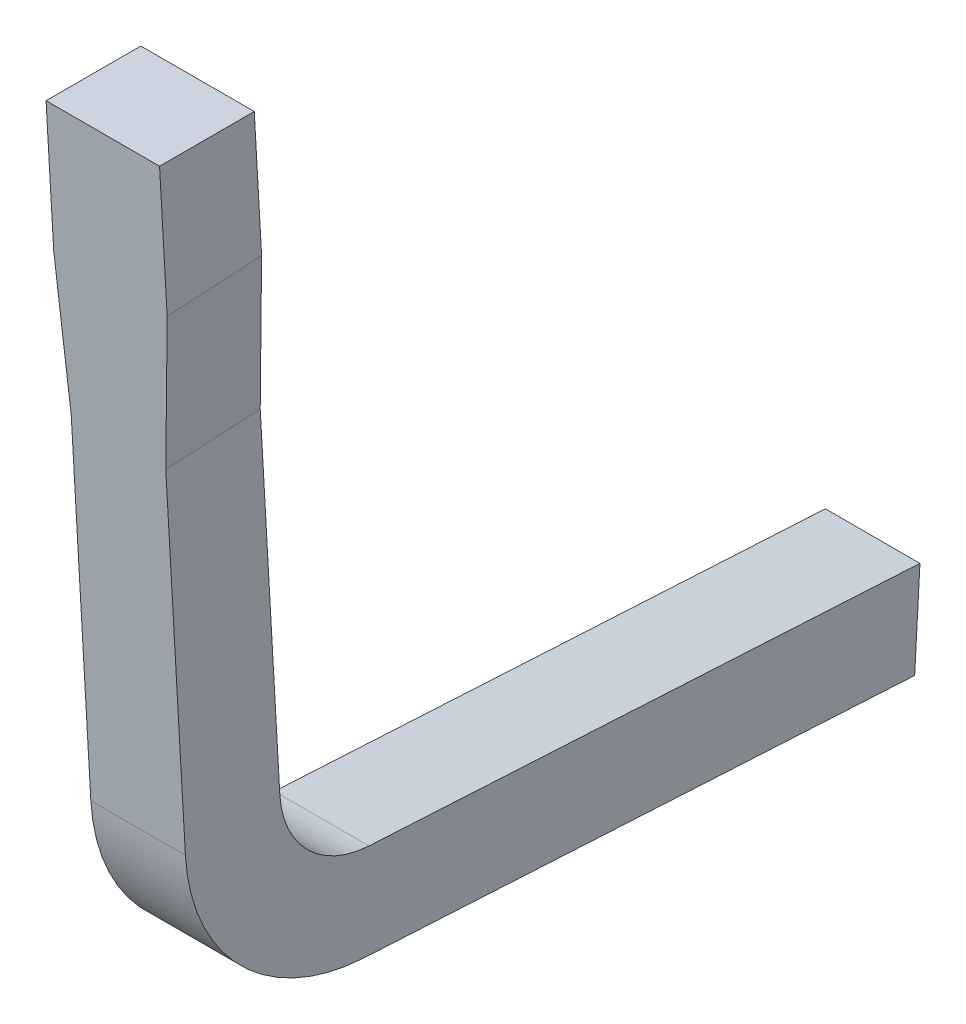
ISO-10303-21;
HEADER;
FILE_DESCRIPTION(('STEP AP214'),'2;1');
FILE_NAME('part.step','',(''),(''),'','','');
FILE_SCHEMA(('AUTOMOTIVE_DESIGN { 1 0 10303 214 1 1 1 1 }'));
ENDSEC;
DATA;
#1=APPLICATION_CONTEXT('core data for automotive mechanical design processes');
#2=APPLICATION_PROTOCOL_DEFINITION('international standard','automotive_design',2000,#1);
#3=PRODUCT_CONTEXT('',#1,'mechanical');
#4=PRODUCT('Part','Part','',(#3));
#5=PRODUCT_RELATED_PRODUCT_CATEGORY('part','',(#4));
#6=PRODUCT_DEFINITION_FORMATION('','',#4);
#7=PRODUCT_DEFINITION_CONTEXT('part definition',#1,'design');
#8=PRODUCT_DEFINITION('design','',#6,#7);
#9=PRODUCT_DEFINITION_SHAPE('','',#8);
#10=(LENGTH_UNIT() NAMED_UNIT(*) SI_UNIT(.MILLI.,.METRE.));
#11=(NAMED_UNIT(*) PLANE_ANGLE_UNIT() SI_UNIT($,.RADIAN.));
#12=(NAMED_UNIT(*) SI_UNIT($,.STERADIAN.) SOLID_ANGLE_UNIT());
#13=UNCERTAINTY_MEASURE_WITH_UNIT(LENGTH_MEASURE(1.E-05),#10,'distance_accuracy_value','');
#14=(GEOMETRIC_REPRESENTATION_CONTEXT(3) GLOBAL_UNCERTAINTY_ASSIGNED_CONTEXT((#13)) GLOBAL_UNIT_ASSIGNED_CONTEXT((#10,
#11,#12)) REPRESENTATION_CONTEXT('',''));
#15=CARTESIAN_POINT('',(0.,0.,0.));
#16=DIRECTION('',(0.,0.,1.));
#17=DIRECTION('',(1.,0.,0.));
#18=AXIS2_PLACEMENT_3D('',#15,#16,#17);
#19=CARTESIAN_POINT('',(2.88,-1.879082198882,-10.32387202233));
#20=DIRECTION('',(1.,0.,0.));
#21=DIRECTION('',(0.,0.,-1.));
#22=AXIS2_PLACEMENT_3D('',#19,#20,#21);
#23=PLANE('',#22);
#24=DIRECTION('',(1.77809156290928E-13,-0.0569406083160486,0.998377567418559));
#25=VECTOR('',#24,1.);
#26=CARTESIAN_POINT('',(2.88,-2.014836222708,-10.43177700759));
#27=LINE('',#26,#25);
#28=CARTESIAN_POINT('',(2.88,-2.01483622270796,-10.4317770075908));
#29=VERTEX_POINT('',#28);
#30=CARTESIAN_POINT('',(2.88000000000001,-2.02622434437119,-10.2321014941066));
#31=VERTEX_POINT('',#30);
#32=EDGE_CURVE('E183',#29,#31,#27,.T.);
#33=ORIENTED_EDGE('',*,*,#32,.T.);
#34=DIRECTION('',(0.,-0.998377567418999,-0.0569406083083299));
#35=VECTOR('',#34,1.);
#36=CARTESIAN_POINT('',(2.88,-2.398052209196,-10.25330800505));
#37=LINE('',#36,#35);
#38=CARTESIAN_POINT('',(2.88,-1.74332817505504,-10.2159670370689));
#39=VERTEX_POINT('',#38);
#40=EDGE_CURVE('E180',#39,#31,#37,.T.);
#41=ORIENTED_EDGE('',*,*,#40,.F.);
#42=DIRECTION('',(0.,0.,1.));
#43=VECTOR('',#42,1.);
#44=CARTESIAN_POINT('',(2.88,-1.743328175055,-10.31612954398));
#45=LINE('',#44,#43);
#46=CARTESIAN_POINT('',(2.88,-1.74332817505473,-10.4162920508947));
#47=VERTEX_POINT('',#46);
#48=EDGE_CURVE('E175',#47,#39,#45,.T.);
#49=ORIENTED_EDGE('',*,*,#48,.F.);
#50=DIRECTION('',(0.,-0.998377567418624,-0.0569406083148914));
#51=VECTOR('',#50,1.);
#52=CARTESIAN_POINT('',(2.88,-2.392358148368,-10.45330826871));
#53=LINE('',#52,#51);
#54=EDGE_CURVE('E205',#47,#29,#53,.T.);
#55=ORIENTED_EDGE('',*,*,#54,.T.);
#56=EDGE_LOOP('',(#33,#41,#49,#55));
#57=FACE_BOUND('',#56,.T.);
#58=ADVANCED_FACE('F17',(#57),#23,.F.);
#59=CARTESIAN_POINT('',(2.89,-2.170286918652,-10.3404803421));
#60=DIRECTION('',(0.997785157856611,0.0664110879137907,0.00378763292362404));
#61=DIRECTION('',(-0.0664115642910679,0.99779231512796,0.));
#62=AXIS2_PLACEMENT_3D('',#59,#60,#61);
#63=PLANE('',#62);
#64=DIRECTION('',(0.0665190105237393,-0.996166318707665,-0.0568144938493813));
#65=VECTOR('',#64,1.);
#66=CARTESIAN_POINT('',(2.88,-2.02622434437119,-10.2321014941066));
#67=LINE('',#66,#65);
#68=CARTESIAN_POINT('',(2.9,-2.32573761459706,-10.2491836765991));
#69=VERTEX_POINT('',#68);
#70=EDGE_CURVE('E161',#31,#69,#67,.T.);
#71=ORIENTED_EDGE('',*,*,#70,.F.);
#72=ORIENTED_EDGE('',*,*,#32,.F.);
#73=DIRECTION('',(0.0665190105237394,-0.996166318707292,-0.0568144938559241));
#74=VECTOR('',#73,1.);
#75=CARTESIAN_POINT('',(2.88,-2.01483622270793,-10.4317770075911));
#76=LINE('',#75,#74);
#77=CARTESIAN_POINT('',(2.9,-2.31434949293379,-10.4488591900838));
#78=VERTEX_POINT('',#77);
#79=EDGE_CURVE('E115',#29,#78,#76,.T.);
#80=ORIENTED_EDGE('',*,*,#79,.T.);
#81=DIRECTION('',(0.,-0.0569406083160594,0.998377567418558));
#82=VECTOR('',#81,1.);
#83=CARTESIAN_POINT('',(2.9,-2.314349492934,-10.44885919008));
#84=LINE('',#83,#82);
#85=EDGE_CURVE('E110',#78,#69,#84,.T.);
#86=ORIENTED_EDGE('',*,*,#85,.T.);
#87=EDGE_LOOP('',(#71,#72,#80,#86));
#88=FACE_BOUND('',#87,.T.);
#89=ADVANCED_FACE('F288',(#88),#63,.F.);
#90=CARTESIAN_POINT('',(3.12,-1.879082198882,-10.32387202233));
#91=DIRECTION('',(1.,0.,0.));
#92=DIRECTION('',(0.,0.,-1.));
#93=AXIS2_PLACEMENT_3D('',#90,#91,#92);
#94=PLANE('',#93);
#95=DIRECTION('',(0.,-0.998377567418624,-0.0569406083148914));
#96=VECTOR('',#95,1.);
#97=CARTESIAN_POINT('',(3.12,-2.392358148368,-10.45330826871));
#98=LINE('',#97,#96);
#99=CARTESIAN_POINT('',(3.12000000000004,-2.01483622270898,-10.4317770075904));
#100=VERTEX_POINT('',#99);
#101=CARTESIAN_POINT('',(3.12,-1.74332817505473,-10.4162920508947));
#102=VERTEX_POINT('',#101);
#103=EDGE_CURVE('E128',#100,#102,#98,.F.);
#104=ORIENTED_EDGE('',*,*,#103,.T.);
#105=DIRECTION('',(0.,0.,1.));
#106=VECTOR('',#105,1.);
#107=CARTESIAN_POINT('',(3.12,-1.743328175055,-10.31612954398));
#108=LINE('',#107,#106);
#109=CARTESIAN_POINT('',(3.12,-1.74332817505504,-10.2159670370692));
#110=VERTEX_POINT('',#109);
#111=EDGE_CURVE('E185',#110,#102,#108,.F.);
#112=ORIENTED_EDGE('',*,*,#111,.F.);
#113=DIRECTION('',(0.,-0.998377567418999,-0.0569406083083299));
#114=VECTOR('',#113,1.);
#115=CARTESIAN_POINT('',(3.12,-2.398052209196,-10.25330800505));
#116=LINE('',#115,#114);
#117=CARTESIAN_POINT('',(3.12000000000002,-2.0262243443712,-10.2321014941066));
#118=VERTEX_POINT('',#117);
#119=EDGE_CURVE('E168',#118,#110,#116,.F.);
#120=ORIENTED_EDGE('',*,*,#119,.F.);
#121=DIRECTION('',(0.,-0.0569406083110753,0.998377567418842));
#122=VECTOR('',#121,1.);
#123=CARTESIAN_POINT('',(3.12000000000007,-2.014836222709,-10.43177700759));
#124=LINE('',#123,#122);
#125=EDGE_CURVE('E131',#100,#118,#124,.T.);
#126=ORIENTED_EDGE('',*,*,#125,.F.);
#127=EDGE_LOOP('',(#104,#112,#120,#126));
#128=FACE_BOUND('',#127,.T.);
#129=ADVANCED_FACE('F251',(#128),#94,.T.);
#130=CARTESIAN_POINT('',(3.,-1.743328175055,-10.31612954398));
#131=DIRECTION('',(0.,1.,0.));
#132=DIRECTION('',(0.,0.,1.));
#133=AXIS2_PLACEMENT_3D('',#130,#131,#132);
#134=PLANE('',#133);
#135=DIRECTION('',(1.,0.,0.));
#136=VECTOR('',#135,1.);
#137=CARTESIAN_POINT('',(3.,-1.74332817505459,-10.4162920508971));
#138=LINE('',#137,#136);
#139=EDGE_CURVE('E138',#102,#47,#138,.F.);
#140=ORIENTED_EDGE('',*,*,#139,.T.);
#141=ORIENTED_EDGE('',*,*,#48,.T.);
#142=DIRECTION('',(1.,0.,0.));
#143=VECTOR('',#142,1.);
#144=CARTESIAN_POINT('',(3.,-1.74332817505506,-10.2159670370689));
#145=LINE('',#144,#143);
#146=EDGE_CURVE('E171',#110,#39,#145,.F.);
#147=ORIENTED_EDGE('',*,*,#146,.F.);
#148=ORIENTED_EDGE('',*,*,#111,.T.);
#149=EDGE_LOOP('',(#140,#141,#147,#148));
#150=FACE_BOUND('',#149,.T.);
#151=ADVANCED_FACE('F291',(#150),#134,.T.);
#152=CARTESIAN_POINT('',(2.9,-2.898875732105,-11.04167004462));
#153=DIRECTION('',(1.,0.,0.));
#154=DIRECTION('',(0.,0.,-1.));
#155=AXIS2_PLACEMENT_3D('',#152,#153,#154);
#156=PLANE('',#155);
#157=CARTESIAN_POINT('',(2.9,-3.03,-10.69));
#158=DIRECTION('',(-1.,0.,0.));
#159=DIRECTION('',(0.,0.,1.));
#160=AXIS2_PLACEMENT_3D('',#157,#158,#159);
#161=CIRCLE('',#160,0.4);
#162=CARTESIAN_POINT('',(2.9,-3.05277624332116,-10.2906489730313));
#163=VERTEX_POINT('',#162);
#164=CARTESIAN_POINT('',(2.9,-3.42937693582933,-10.6676826720305));
#165=VERTEX_POINT('',#164);
#166=EDGE_CURVE('E155',#163,#165,#161,.F.);
#167=ORIENTED_EDGE('',*,*,#166,.F.);
#168=DIRECTION('',(0.,-0.998377567418999,-0.0569406083083299));
#169=VECTOR('',#168,1.);
#170=CARTESIAN_POINT('',(2.9,-2.398052209196,-10.25330800505));
#171=LINE('',#170,#169);
#172=EDGE_CURVE('E158',#69,#163,#171,.T.);
#173=ORIENTED_EDGE('',*,*,#172,.F.);
#174=ORIENTED_EDGE('',*,*,#85,.F.);
#175=DIRECTION('',(0.,-0.998377567418624,-0.0569406083148914));
#176=VECTOR('',#175,1.);
#177=CARTESIAN_POINT('',(2.9,-2.392358148368,-10.45330826871));
#178=LINE('',#177,#176);
#179=CARTESIAN_POINT('',(2.9,-3.0413881216286,-10.4903244865199));
#180=VERTEX_POINT('',#179);
#181=EDGE_CURVE('E104',#78,#180,#178,.T.);
#182=ORIENTED_EDGE('',*,*,#181,.T.);
#183=CARTESIAN_POINT('',(2.9,-3.03,-10.69));
#184=DIRECTION('',(-1.,0.,0.));
#185=DIRECTION('',(0.,0.,1.));
#186=AXIS2_PLACEMENT_3D('',#183,#184,#185);
#187=CIRCLE('',#186,0.2);
#188=CARTESIAN_POINT('',(2.9,-3.22968846791482,-10.6788413360177));
#189=VERTEX_POINT('',#188);
#190=EDGE_CURVE('E20',#180,#189,#187,.F.);
#191=ORIENTED_EDGE('',*,*,#190,.T.);
#192=DIRECTION('',(0.,0.0557933199228295,0.998442339572991));
#193=VECTOR('',#192,1.);
#194=CARTESIAN_POINT('',(2.9,-3.262244863925,-11.26145022621));
#195=LINE('',#194,#193);
#196=CARTESIAN_POINT('',(2.9,-3.29480125993501,-11.8440591164004));
#197=VERTEX_POINT('',#196);
#198=EDGE_CURVE('E123',#197,#189,#195,.T.);
#199=ORIENTED_EDGE('',*,*,#198,.F.);
#200=DIRECTION('',(0.,-0.998442339574031,0.0557933199042218));
#201=VECTOR('',#200,1.);
#202=CARTESIAN_POINT('',(2.9,-3.394645493892,-11.83847978441));
#203=LINE('',#202,#201);
#204=CARTESIAN_POINT('',(2.9,-3.49448972784906,-11.8329004524196));
#205=VERTEX_POINT('',#204);
#206=EDGE_CURVE('E148',#197,#205,#203,.T.);
#207=ORIENTED_EDGE('',*,*,#206,.T.);
#208=DIRECTION('',(0.,0.055793319922371,0.998442339573017));
#209=VECTOR('',#208,1.);
#210=CARTESIAN_POINT('',(2.9,-3.461933331839,-11.25029156222));
#211=LINE('',#210,#209);
#212=EDGE_CURVE('E153',#205,#165,#211,.T.);
#213=ORIENTED_EDGE('',*,*,#212,.T.);
#214=EDGE_LOOP('',(#167,#173,#174,#182,#191,#199,#207,#213));
#215=FACE_BOUND('',#214,.T.);
#216=ADVANCED_FACE('F107',(#215),#156,.F.);
#217=CARTESIAN_POINT('',(3.,-3.262244863925,-11.26145022621));
#218=DIRECTION('',(0.,0.998442339572991,-0.0557933199228295));
#219=DIRECTION('',(0.,0.0557933199228295,0.998442339572991));
#220=AXIS2_PLACEMENT_3D('',#217,#218,#219);
#221=PLANE('',#220);
#222=DIRECTION('',(0.,0.055793319922887,0.998442339572988));
#223=VECTOR('',#222,1.);
#224=CARTESIAN_POINT('',(3.1,-3.294801259935,-11.8440591164));
#225=LINE('',#224,#223);
#226=CARTESIAN_POINT('',(3.1,-3.29480125993501,-11.8440591164001));
#227=VERTEX_POINT('',#226);
#228=CARTESIAN_POINT('',(3.1,-3.2296884679148,-10.6788413360177));
#229=VERTEX_POINT('',#228);
#230=EDGE_CURVE('E142',#227,#229,#225,.T.);
#231=ORIENTED_EDGE('',*,*,#230,.F.);
#232=DIRECTION('',(1.,0.,0.));
#233=VECTOR('',#232,1.);
#234=CARTESIAN_POINT('',(3.,-3.29480125993502,-11.8440591164004));
#235=LINE('',#234,#233);
#236=EDGE_CURVE('E139',#227,#197,#235,.F.);
#237=ORIENTED_EDGE('',*,*,#236,.T.);
#238=ORIENTED_EDGE('',*,*,#198,.T.);
#239=DIRECTION('',(-1.,0.,0.));
#240=VECTOR('',#239,1.);
#241=CARTESIAN_POINT('',(3.104,-3.22968846791485,-10.67884133602));
#242=LINE('',#241,#240);
#243=EDGE_CURVE('E122',#189,#229,#242,.F.);
#244=ORIENTED_EDGE('',*,*,#243,.T.);
#245=EDGE_LOOP('',(#231,#237,#238,#244));
#246=FACE_BOUND('',#245,.T.);
#247=ADVANCED_FACE('F284',(#246),#221,.T.);
#248=CARTESIAN_POINT('',(3.104,-3.03,-10.69));
#249=DIRECTION('',(-1.,0.,0.));
#250=DIRECTION('',(0.,0.,1.));
#251=AXIS2_PLACEMENT_3D('',#248,#249,#250);
#252=CYLINDRICAL_SURFACE('',#251,0.2);
#253=ORIENTED_EDGE('',*,*,#190,.F.);
#254=DIRECTION('',(1.,0.,0.));
#255=VECTOR('',#254,1.);
#256=CARTESIAN_POINT('',(3.,-3.04138812159455,-10.4903244865179));
#257=LINE('',#256,#255);
#258=CARTESIAN_POINT('',(3.1,-3.04138812162905,-10.4903244865184));
#259=VERTEX_POINT('',#258);
#260=EDGE_CURVE('E114',#180,#259,#257,.T.);
#261=ORIENTED_EDGE('',*,*,#260,.T.);
#262=CARTESIAN_POINT('',(3.1,-3.03,-10.69));
#263=DIRECTION('',(-1.,0.,0.));
#264=DIRECTION('',(0.,0.,1.));
#265=AXIS2_PLACEMENT_3D('',#262,#263,#264);
#266=CIRCLE('',#265,0.2);
#267=EDGE_CURVE('E223',#229,#259,#266,.T.);
#268=ORIENTED_EDGE('',*,*,#267,.F.);
#269=ORIENTED_EDGE('',*,*,#243,.F.);
#270=EDGE_LOOP('',(#253,#261,#268,#269));
#271=FACE_BOUND('',#270,.T.);
#272=ADVANCED_FACE('F119',(#271),#252,.F.);
#273=CARTESIAN_POINT('',(3.,-2.392358148368,-10.45330826871));
#274=DIRECTION('',(0.,-0.0569406083148914,0.998377567418624));
#275=DIRECTION('',(0.,-0.998377567418624,-0.0569406083148914));
#276=AXIS2_PLACEMENT_3D('',#273,#274,#275);
#277=PLANE('',#276);
#278=DIRECTION('',(0.0665190105240592,0.996166318708109,0.0568144938412267));
#279=VECTOR('',#278,1.);
#280=CARTESIAN_POINT('',(3.10000000000004,-2.314349492934,-10.44885919008));
#281=LINE('',#280,#279);
#282=CARTESIAN_POINT('',(3.10000000000001,-2.314349492934,-10.44885919008));
#283=VERTEX_POINT('',#282);
#284=EDGE_CURVE('E165',#283,#100,#281,.T.);
#285=ORIENTED_EDGE('',*,*,#284,.F.);
#286=DIRECTION('',(0.,0.998377567418421,0.0569406083184697));
#287=VECTOR('',#286,1.);
#288=CARTESIAN_POINT('',(3.1,-3.041388121684,-10.49032448652));
#289=LINE('',#288,#287);
#290=EDGE_CURVE('E126',#259,#283,#289,.T.);
#291=ORIENTED_EDGE('',*,*,#290,.F.);
#292=ORIENTED_EDGE('',*,*,#260,.F.);
#293=ORIENTED_EDGE('',*,*,#181,.F.);
#294=ORIENTED_EDGE('',*,*,#79,.F.);
#295=ORIENTED_EDGE('',*,*,#54,.F.);
#296=ORIENTED_EDGE('',*,*,#139,.F.);
#297=ORIENTED_EDGE('',*,*,#103,.F.);
#298=EDGE_LOOP('',(#285,#291,#292,#293,#294,#295,#296,#297));
#299=FACE_BOUND('',#298,.T.);
#300=ADVANCED_FACE('F124',(#299),#277,.F.);
#301=CARTESIAN_POINT('',(3.11,-2.170286918653,-10.3404803421));
#302=DIRECTION('',(0.99778515785659,-0.0664110879141193,-0.00378763292348296));
#303=DIRECTION('',(0.0664115642913965,0.997792315127938,0.));
#304=AXIS2_PLACEMENT_3D('',#301,#302,#303);
#305=PLANE('',#304);
#306=DIRECTION('',(0.,-0.0569406083160594,0.998377567418558));
#307=VECTOR('',#306,1.);
#308=CARTESIAN_POINT('',(3.1,-2.314349492934,-10.44885919008));
#309=LINE('',#308,#307);
#310=CARTESIAN_POINT('',(3.1,-2.32573761459702,-10.2491836765997));
#311=VERTEX_POINT('',#310);
#312=EDGE_CURVE('E238',#283,#311,#309,.T.);
#313=ORIENTED_EDGE('',*,*,#312,.F.);
#314=ORIENTED_EDGE('',*,*,#284,.T.);
#315=ORIENTED_EDGE('',*,*,#125,.T.);
#316=DIRECTION('',(0.0665190105237393,0.996166318707665,0.0568144938493813));
#317=VECTOR('',#316,1.);
#318=CARTESIAN_POINT('',(3.1,-2.32573761459705,-10.2491836765991));
#319=LINE('',#318,#317);
#320=EDGE_CURVE('E160',#311,#118,#319,.T.);
#321=ORIENTED_EDGE('',*,*,#320,.F.);
#322=EDGE_LOOP('',(#313,#314,#315,#321));
#323=FACE_BOUND('',#322,.T.);
#324=ADVANCED_FACE('F245',(#323),#305,.T.);
#325=CARTESIAN_POINT('',(3.,-2.398052209196,-10.25330800505));
#326=DIRECTION('',(0.,-0.0569406083083299,0.998377567418999));
#327=DIRECTION('',(0.,-0.998377567418999,-0.0569406083083299));
#328=AXIS2_PLACEMENT_3D('',#325,#326,#327);
#329=PLANE('',#328);
#330=ORIENTED_EDGE('',*,*,#119,.T.);
#331=ORIENTED_EDGE('',*,*,#146,.T.);
#332=ORIENTED_EDGE('',*,*,#40,.T.);
#333=ORIENTED_EDGE('',*,*,#70,.T.);
#334=ORIENTED_EDGE('',*,*,#172,.T.);
#335=DIRECTION('',(-1.,0.,0.));
#336=VECTOR('',#335,1.);
#337=CARTESIAN_POINT('',(3.104,-3.05277624331888,-10.2906489730321));
#338=LINE('',#337,#336);
#339=CARTESIAN_POINT('',(3.1,-3.05277624332089,-10.2906489730312));
#340=VERTEX_POINT('',#339);
#341=EDGE_CURVE('E198',#340,#163,#338,.T.);
#342=ORIENTED_EDGE('',*,*,#341,.F.);
#343=DIRECTION('',(0.,-0.998377567419076,-0.0569406083069694));
#344=VECTOR('',#343,1.);
#345=CARTESIAN_POINT('',(3.1,-2.325737614597,-10.2491836766));
#346=LINE('',#345,#344);
#347=EDGE_CURVE('E222',#311,#340,#346,.T.);
#348=ORIENTED_EDGE('',*,*,#347,.F.);
#349=ORIENTED_EDGE('',*,*,#320,.T.);
#350=EDGE_LOOP('',(#330,#331,#332,#333,#334,#342,#348,#349));
#351=FACE_BOUND('',#350,.T.);
#352=ADVANCED_FACE('F255',(#351),#329,.T.);
#353=CARTESIAN_POINT('',(3.104,-3.03,-10.69));
#354=DIRECTION('',(-1.,0.,0.));
#355=DIRECTION('',(0.,0.,1.));
#356=AXIS2_PLACEMENT_3D('',#353,#354,#355);
#357=CYLINDRICAL_SURFACE('',#356,0.4);
#358=DIRECTION('',(1.,0.,0.));
#359=VECTOR('',#358,1.);
#360=CARTESIAN_POINT('',(3.,-3.4293769358293,-10.66768267203));
#361=LINE('',#360,#359);
#362=CARTESIAN_POINT('',(3.1,-3.42937693582946,-10.6676826720306));
#363=VERTEX_POINT('',#362);
#364=EDGE_CURVE('E150',#165,#363,#361,.T.);
#365=ORIENTED_EDGE('',*,*,#364,.T.);
#366=CARTESIAN_POINT('',(3.1,-3.03,-10.69));
#367=DIRECTION('',(-1.,0.,0.));
#368=DIRECTION('',(0.,0.,1.));
#369=AXIS2_PLACEMENT_3D('',#366,#367,#368);
#370=CIRCLE('',#369,0.4);
#371=EDGE_CURVE('E219',#340,#363,#370,.F.);
#372=ORIENTED_EDGE('',*,*,#371,.F.);
#373=ORIENTED_EDGE('',*,*,#341,.T.);
#374=ORIENTED_EDGE('',*,*,#166,.T.);
#375=EDGE_LOOP('',(#365,#372,#373,#374));
#376=FACE_BOUND('',#375,.T.);
#377=ADVANCED_FACE('F273',(#376),#357,.T.);
#378=CARTESIAN_POINT('',(3.,-3.461933331839,-11.25029156222));
#379=DIRECTION('',(0.,0.998442339573017,-0.055793319922371));
#380=DIRECTION('',(0.,0.055793319922371,0.998442339573017));
#381=AXIS2_PLACEMENT_3D('',#378,#379,#380);
#382=PLANE('',#381);
#383=ORIENTED_EDGE('',*,*,#364,.F.);
#384=ORIENTED_EDGE('',*,*,#212,.F.);
#385=DIRECTION('',(1.,0.,0.));
#386=VECTOR('',#385,1.);
#387=CARTESIAN_POINT('',(3.,-3.49448972784898,-11.8329004524196));
#388=LINE('',#387,#386);
#389=CARTESIAN_POINT('',(3.1,-3.49448972784899,-11.8329004524199));
#390=VERTEX_POINT('',#389);
#391=EDGE_CURVE('E35',#205,#390,#388,.T.);
#392=ORIENTED_EDGE('',*,*,#391,.T.);
#393=DIRECTION('',(0.,-0.0557933199219327,-0.998442339573042));
#394=VECTOR('',#393,1.);
#395=CARTESIAN_POINT('',(3.1,-3.429376935829,-10.66768267202));
#396=LINE('',#395,#394);
#397=EDGE_CURVE('E26',#363,#390,#396,.T.);
#398=ORIENTED_EDGE('',*,*,#397,.F.);
#399=EDGE_LOOP('',(#383,#384,#392,#398));
#400=FACE_BOUND('',#399,.T.);
#401=ADVANCED_FACE('F274',(#400),#382,.F.);
#402=CARTESIAN_POINT('',(3.,-3.394645493892,-11.83847978441));
#403=DIRECTION('',(0.,0.0557933199042218,0.998442339574031));
#404=DIRECTION('',(0.,-0.998442339574031,0.0557933199042218));
#405=AXIS2_PLACEMENT_3D('',#402,#403,#404);
#406=PLANE('',#405);
#407=DIRECTION('',(0.,0.998442339574254,-0.0557933199002383));
#408=VECTOR('',#407,1.);
#409=CARTESIAN_POINT('',(3.1,-3.494489727849,-11.83290045242));
#410=LINE('',#409,#408);
#411=EDGE_CURVE('E11',#390,#227,#410,.T.);
#412=ORIENTED_EDGE('',*,*,#411,.F.);
#413=ORIENTED_EDGE('',*,*,#391,.F.);
#414=ORIENTED_EDGE('',*,*,#206,.F.);
#415=ORIENTED_EDGE('',*,*,#236,.F.);
#416=EDGE_LOOP('',(#412,#413,#414,#415));
#417=FACE_BOUND('',#416,.T.);
#418=ADVANCED_FACE('F281',(#417),#406,.F.);
#419=CARTESIAN_POINT('',(3.1,-2.909472777839,-11.05227927458));
#420=DIRECTION('',(1.,0.,0.));
#421=DIRECTION('',(0.,0.,-1.));
#422=AXIS2_PLACEMENT_3D('',#419,#420,#421);
#423=PLANE('',#422);
#424=ORIENTED_EDGE('',*,*,#397,.T.);
#425=ORIENTED_EDGE('',*,*,#411,.T.);
#426=ORIENTED_EDGE('',*,*,#230,.T.);
#427=ORIENTED_EDGE('',*,*,#267,.T.);
#428=ORIENTED_EDGE('',*,*,#290,.T.);
#429=ORIENTED_EDGE('',*,*,#312,.T.);
#430=ORIENTED_EDGE('',*,*,#347,.T.);
#431=ORIENTED_EDGE('',*,*,#371,.T.);
#432=EDGE_LOOP('',(#424,#425,#426,#427,#428,#429,#430,#431));
#433=FACE_BOUND('',#432,.T.);
#434=ADVANCED_FACE('F260',(#433),#423,.T.);
#435=CLOSED_SHELL('',(#58,#89,#129,#151,#216,#247,#272,#300,#324,#352,#377,#401,#418,#434));
#436=MANIFOLD_SOLID_BREP('B1',#435);
#437=ADVANCED_BREP_SHAPE_REPRESENTATION('',(#18,#436),#14);
#438=SHAPE_DEFINITION_REPRESENTATION(#9,#437);
ENDSEC;
END-ISO-10303-21;
